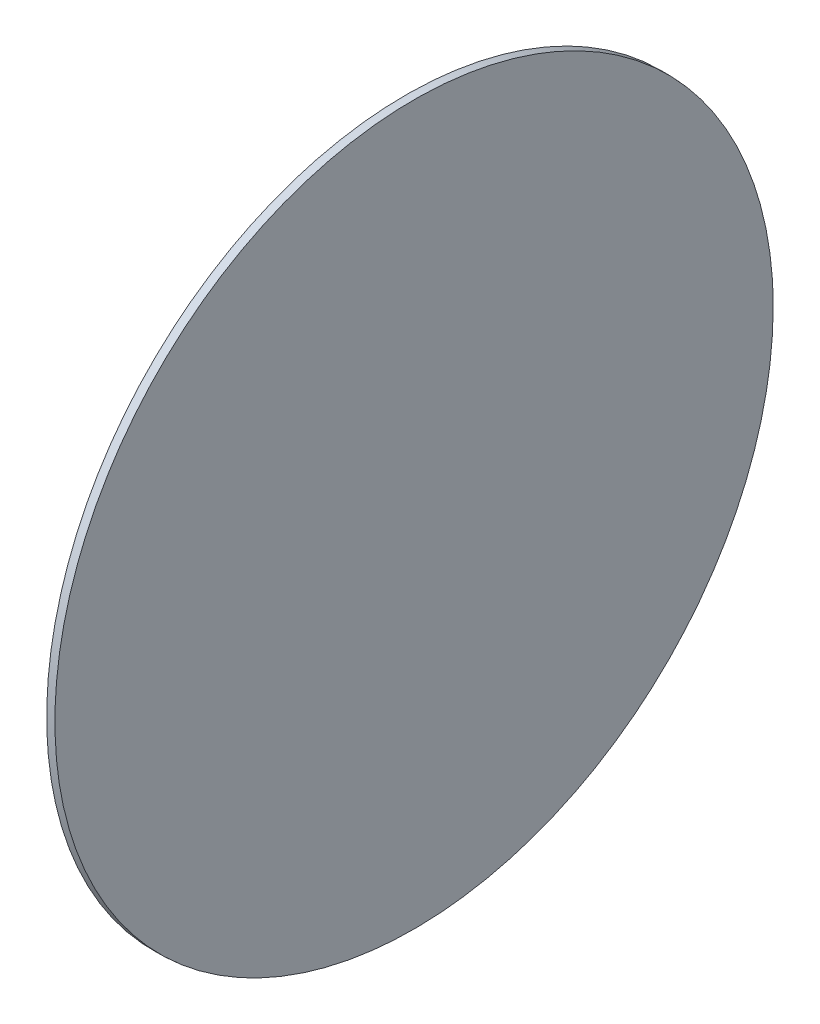
ISO-10303-21;
HEADER;
FILE_DESCRIPTION(('STEP AP214'),'2;1');
FILE_NAME('part.step','',(''),(''),'','','');
FILE_SCHEMA(('AUTOMOTIVE_DESIGN { 1 0 10303 214 1 1 1 1 }'));
ENDSEC;
DATA;
#1=APPLICATION_CONTEXT('core data for automotive mechanical design processes');
#2=APPLICATION_PROTOCOL_DEFINITION('international standard','automotive_design',2000,#1);
#3=PRODUCT_CONTEXT('',#1,'mechanical');
#4=PRODUCT('Part','Part','',(#3));
#5=PRODUCT_RELATED_PRODUCT_CATEGORY('part','',(#4));
#6=PRODUCT_DEFINITION_FORMATION('','',#4);
#7=PRODUCT_DEFINITION_CONTEXT('part definition',#1,'design');
#8=PRODUCT_DEFINITION('design','',#6,#7);
#9=PRODUCT_DEFINITION_SHAPE('','',#8);
#10=(LENGTH_UNIT() NAMED_UNIT(*) SI_UNIT(.MILLI.,.METRE.));
#11=(NAMED_UNIT(*) PLANE_ANGLE_UNIT() SI_UNIT($,.RADIAN.));
#12=(NAMED_UNIT(*) SI_UNIT($,.STERADIAN.) SOLID_ANGLE_UNIT());
#13=UNCERTAINTY_MEASURE_WITH_UNIT(LENGTH_MEASURE(1.E-05),#10,'distance_accuracy_value','');
#14=(GEOMETRIC_REPRESENTATION_CONTEXT(3) GLOBAL_UNCERTAINTY_ASSIGNED_CONTEXT((#13)) GLOBAL_UNIT_ASSIGNED_CONTEXT((#10,
#11,#12)) REPRESENTATION_CONTEXT('',''));
#15=CARTESIAN_POINT('',(0.,0.,0.));
#16=DIRECTION('',(0.,0.,1.));
#17=DIRECTION('',(1.,0.,0.));
#18=AXIS2_PLACEMENT_3D('',#15,#16,#17);
#19=CARTESIAN_POINT('',(256.137650820257,176.743383940744,-231.47823397477));
#20=CARTESIAN_POINT('',(256.137650820257,168.330757265667,-231.47823397477));
#21=CARTESIAN_POINT('',(256.137650820257,151.505503915513,-230.651662281104));
#22=CARTESIAN_POINT('',(256.137650820257,126.510678471353,-226.944030165496));
#23=CARTESIAN_POINT('',(256.137650820257,101.999621440854,-220.804329998851));
#24=CARTESIAN_POINT('',(256.137650820257,78.2083877023261,-212.291690450074));
#25=CARTESIAN_POINT('',(256.137650820257,55.3660998422819,-201.488092891503));
#26=CARTESIAN_POINT('',(256.137650820257,33.6927415796788,-188.497581873475));
#27=CARTESIAN_POINT('',(256.137650820257,13.3970392024482,-173.445263118427));
#28=CARTESIAN_POINT('',(256.137650820257,-5.32554858075743,-156.476098684406));
#29=CARTESIAN_POINT('',(256.137650820257,-22.2947130147782,-137.7535109012));
#30=CARTESIAN_POINT('',(256.137650820257,-37.347031769826,-117.45780852397));
#31=CARTESIAN_POINT('',(256.137650820257,-50.3375427878549,-95.7844502613667));
#32=CARTESIAN_POINT('',(256.137650820257,-61.1411403464257,-72.9421624013225));
#33=CARTESIAN_POINT('',(256.137650820257,-69.6537798952023,-49.1509286627942));
#34=CARTESIAN_POINT('',(256.137650820257,-75.7934800618477,-24.6398716322952));
#35=CARTESIAN_POINT('',(256.137650820257,-79.5011121774556,0.354953811864101));
#36=CARTESIAN_POINT('',(256.137650820257,-80.740969717955,25.5928338370949));
#37=CARTESIAN_POINT('',(256.137650820257,-79.5011121774557,50.8307138623259));
#38=CARTESIAN_POINT('',(256.137650820257,-75.7934800618476,75.825539306485));
#39=CARTESIAN_POINT('',(256.137650820257,-69.6537798952023,100.336596336984));
#40=CARTESIAN_POINT('',(256.137650820257,-61.1411403464257,124.127830075512));
#41=CARTESIAN_POINT('',(256.137650820257,-50.3375427878549,146.970117935557));
#42=CARTESIAN_POINT('',(256.137650820257,-37.347031769826,168.64347619816));
#43=CARTESIAN_POINT('',(256.137650820257,-22.2947130147783,188.93917857539));
#44=CARTESIAN_POINT('',(256.137650820257,-5.3255485807575,207.661766358596));
#45=CARTESIAN_POINT('',(256.137650820257,13.3970392024483,224.630930792617));
#46=CARTESIAN_POINT('',(256.137650820257,33.6927415796788,239.683249547665));
#47=CARTESIAN_POINT('',(256.137650820257,55.3660998422819,252.673760565693));
#48=CARTESIAN_POINT('',(256.137650820257,78.2083877023262,263.477358124264));
#49=CARTESIAN_POINT('',(256.137650820257,101.999621440854,271.989997673041));
#50=CARTESIAN_POINT('',(256.137650820257,126.510678471353,278.129697839686));
#51=CARTESIAN_POINT('',(256.137650820257,151.505503915513,281.837329955294));
#52=CARTESIAN_POINT('',(256.137650820257,176.743383940744,283.077187495794));
#53=CARTESIAN_POINT('',(256.137650820257,201.981263965974,281.837329955294));
#54=CARTESIAN_POINT('',(256.137650820257,226.976089410134,278.129697839686));
#55=CARTESIAN_POINT('',(256.137650820257,251.487146440633,271.989997673041));
#56=CARTESIAN_POINT('',(256.137650820257,275.278380179161,263.477358124264));
#57=CARTESIAN_POINT('',(256.137650820257,298.120668039205,252.673760565693));
#58=CARTESIAN_POINT('',(256.137650820257,319.794026301808,239.683249547665));
#59=CARTESIAN_POINT('',(256.137650820257,340.089728679039,224.630930792617));
#60=CARTESIAN_POINT('',(256.137650820257,358.812316462244,207.661766358596));
#61=CARTESIAN_POINT('',(256.137650820257,375.781480896266,188.93917857539));
#62=CARTESIAN_POINT('',(256.137650820257,390.833799651313,168.64347619816));
#63=CARTESIAN_POINT('',(256.137650820257,403.824310669342,146.970117935557));
#64=CARTESIAN_POINT('',(256.137650820257,414.627908227913,124.127830075512));
#65=CARTESIAN_POINT('',(256.137650820257,423.140547776689,100.336596336984));
#66=CARTESIAN_POINT('',(256.137650820257,429.280247943335,75.8255393064853));
#67=CARTESIAN_POINT('',(256.137650820257,432.987880058943,50.830713862326));
#68=CARTESIAN_POINT('',(256.137650820257,434.227737599442,25.5928338370949));
#69=CARTESIAN_POINT('',(256.137650820257,432.987880058943,0.354953811864209));
#70=CARTESIAN_POINT('',(256.137650820257,429.280247943335,-24.6398716322952));
#71=CARTESIAN_POINT('',(256.137650820257,423.140547776689,-49.1509286627942));
#72=CARTESIAN_POINT('',(256.137650820257,414.627908227913,-72.9421624013226));
#73=CARTESIAN_POINT('',(256.137650820257,403.824310669342,-95.7844502613666));
#74=CARTESIAN_POINT('',(256.137650820257,390.833799651313,-117.45780852397));
#75=CARTESIAN_POINT('',(256.137650820257,375.781480896265,-137.7535109012));
#76=CARTESIAN_POINT('',(256.137650820257,358.812316462245,-156.476098684406));
#77=CARTESIAN_POINT('',(256.137650820257,340.089728679039,-173.445263118427));
#78=CARTESIAN_POINT('',(256.137650820257,319.794026301809,-188.497581873475));
#79=CARTESIAN_POINT('',(256.137650820257,298.120668039205,-201.488092891503));
#80=CARTESIAN_POINT('',(256.137650820257,275.278380179161,-212.291690450074));
#81=CARTESIAN_POINT('',(256.137650820257,251.487146440633,-220.804329998851));
#82=CARTESIAN_POINT('',(256.137650820257,226.976089410134,-226.944030165496));
#83=CARTESIAN_POINT('',(256.137650820257,201.981263965974,-230.651662281104));
#84=CARTESIAN_POINT('',(256.137650820257,185.156010615821,-231.47823397477));
#85=CARTESIAN_POINT('',(256.137650820257,176.743383940744,-231.47823397477));
#86=B_SPLINE_CURVE_WITH_KNOTS('',3,(#19,#20,#21,#22,#23,#24,#25,#26,#27,#28,#29,#30,#31,#32,#33,
#34,#35,#36,#37,#38,#39,#40,#41,#42,#43,#44,#45,#46,#47,#48,#49,#50,#51,#52,#53,#54,#55,#56,#57,
#58,#59,#60,#61,#62,#63,#64,#65,#66,#67,#68,#69,#70,#71,#72,#73,#74,#75,#76,#77,#78,#79,#80,#81,
#82,#83,#84,#85),.UNSPECIFIED.,.T.,.F.,(4,1,1,1,1,1,1,1,1,1,1,1,1,1,1,1,1,1,1,1,1,1,1,1,1,1,1,1,
1,1,1,1,1,1,1,1,1,1,1,1,1,1,1,1,1,1,1,1,1,1,1,1,1,1,1,1,1,1,1,1,1,1,1,1,4),(0.,0.015625,0.03125,
0.046875,0.0625,0.0781249999999999,0.0937499999999999,0.109375,0.125,0.140625,0.15625,0.171875,
0.1875,0.203125,0.21875,0.234375,0.25,0.265625,0.28125,0.296875,0.3125,0.328125,0.34375,
0.359375,0.375,0.390625,0.40625,0.421875,0.4375,0.453125,0.46875,0.484375,0.5,0.515625,0.53125,
0.546875,0.5625,0.578125,0.59375,0.609375,0.625,0.640625,0.65625,0.671875,0.6875,0.703125,
0.71875,0.734375,0.75,0.765625,0.78125,0.796875,0.8125,0.828125,0.84375,0.859375,0.875,0.890625,
0.90625,0.921875,0.9375,0.953125,0.96875,0.984375,1.),.UNSPECIFIED.);
#87=DIRECTION('',(1.,0.,0.));
#88=VECTOR('',#87,1.);
#89=SURFACE_OF_LINEAR_EXTRUSION('',#86,#88);
#90=CARTESIAN_POINT('',(256.137650820257,176.743383940744,-231.47823397477));
#91=CARTESIAN_POINT('',(256.137650820257,180.949697278282,-231.47823397477));
#92=CARTESIAN_POINT('',(256.137650820257,185.156010615821,-231.374912513062));
#93=CARTESIAN_POINT('',(256.137650820257,193.558510016686,-230.962124187308));
#94=CARTESIAN_POINT('',(256.137650820257,197.754696080013,-230.652657323262));
#95=CARTESIAN_POINT('',(256.137650820257,206.126813658245,-229.828075713911));
#96=CARTESIAN_POINT('',(256.137650820257,210.30274517315,-229.312960968605));
#97=CARTESIAN_POINT('',(256.137650820257,218.624323911511,-228.078571368572));
#98=CARTESIAN_POINT('',(256.137650820257,222.769971134969,-227.359296513844));
#99=CARTESIAN_POINT('',(256.137650820257,231.020951547412,-225.718074466802));
#100=CARTESIAN_POINT('',(256.137650820257,235.126284736398,-224.796127274488));
#101=CARTESIAN_POINT('',(256.137650820257,243.286801459968,-222.752024246811));
#102=CARTESIAN_POINT('',(256.137650820257,247.341984994552,-221.629868411448));
#103=CARTESIAN_POINT('',(256.137650820257,255.39236678939,-219.187811792211));
#104=CARTESIAN_POINT('',(256.137650820257,259.387565049643,-217.867911008337));
#105=CARTESIAN_POINT('',(256.137650820257,267.308429521381,-215.033780382592));
#106=CARTESIAN_POINT('',(256.137650820257,271.234095732866,-213.519550540721));
#107=CARTESIAN_POINT('',(256.137650820257,279.006349332628,-210.300177689496));
#108=CARTESIAN_POINT('',(256.137650820257,282.852936720906,-208.595034680143));
#109=CARTESIAN_POINT('',(256.137650820257,290.457866685964,-204.99817068355));
#110=CARTESIAN_POINT('',(256.137650820257,294.216209262744,-203.10644969631));
#111=CARTESIAN_POINT('',(256.137650820257,301.635483616519,-199.140764933544));
#112=CARTESIAN_POINT('',(256.137650820257,305.296415393513,-197.066801158016));
#113=CARTESIAN_POINT('',(256.137650820257,312.51217121905,-192.741843557108));
#114=CARTESIAN_POINT('',(256.137650820257,316.066995267594,-190.490849731728));
#115=CARTESIAN_POINT('',(256.137650820257,323.061838707566,-185.817044769548));
#116=CARTESIAN_POINT('',(256.137650820257,326.501858098995,-183.39423363275));
#117=CARTESIAN_POINT('',(256.137650820257,333.258948111878,-178.382834133486));
#118=CARTESIAN_POINT('',(256.137650820257,336.576018733332,-175.79424577102));
#119=CARTESIAN_POINT('',(256.137650820257,343.079067093404,-170.457331906176));
#120=CARTESIAN_POINT('',(256.137650820257,346.265044832023,-167.709006403796));
#121=CARTESIAN_POINT('',(256.137650820257,352.498394561627,-162.059427522864));
#122=CARTESIAN_POINT('',(256.137650820257,355.545766552611,-159.158174144311));
#123=CARTESIAN_POINT('',(256.137650820257,361.494391922149,-153.209548774773));
#124=CARTESIAN_POINT('',(256.137650820257,364.395645300702,-150.162176783788));
#125=CARTESIAN_POINT('',(256.137650820257,370.045224181634,-143.928827054185));
#126=CARTESIAN_POINT('',(256.137650820257,372.793549684014,-140.742849315566));
#127=CARTESIAN_POINT('',(256.137650820257,378.130463548859,-134.239800955493));
#128=CARTESIAN_POINT('',(256.137650820257,380.719051911324,-130.922730334039));
#129=CARTESIAN_POINT('',(256.137650820257,385.730451410588,-124.165640321156));
#130=CARTESIAN_POINT('',(256.137650820257,388.153262547387,-120.725620929727));
#131=CARTESIAN_POINT('',(256.137650820257,392.827067509566,-113.730777489755));
#132=CARTESIAN_POINT('',(256.137650820257,395.078061334947,-110.175953441212));
#133=CARTESIAN_POINT('',(256.137650820257,399.403018935855,-102.960197615674));
#134=CARTESIAN_POINT('',(256.137650820257,401.476982711382,-99.2992658386805));
#135=CARTESIAN_POINT('',(256.137650820257,405.442667474149,-91.879991484906));
#136=CARTESIAN_POINT('',(256.137650820257,407.334388461388,-88.1216489081254));
#137=CARTESIAN_POINT('',(256.137650820257,410.931252457981,-80.5167189430672));
#138=CARTESIAN_POINT('',(256.137650820257,412.636395467335,-76.6701315547897));
#139=CARTESIAN_POINT('',(256.137650820257,415.855768318559,-68.8978779550276));
#140=CARTESIAN_POINT('',(256.137650820257,417.36999816043,-64.972211743543));
#141=CARTESIAN_POINT('',(256.137650820257,420.204128786175,-57.051347271805));
#142=CARTESIAN_POINT('',(256.137650820257,421.524029570049,-53.0561490115515));
#143=CARTESIAN_POINT('',(256.137650820257,423.966086189286,-45.0057672167136));
#144=CARTESIAN_POINT('',(256.137650820257,425.088242024649,-40.9505836821292));
#145=CARTESIAN_POINT('',(256.137650820257,427.132345052326,-32.7900669585592));
#146=CARTESIAN_POINT('',(256.137650820257,428.054292244641,-28.6847337695735));
#147=CARTESIAN_POINT('',(256.137650820257,429.695514291683,-20.4337533571305));
#148=CARTESIAN_POINT('',(256.137650820257,430.414789146411,-16.2881061336731));
#149=CARTESIAN_POINT('',(256.137650820257,431.649178746444,-7.9665273953112));
#150=CARTESIAN_POINT('',(256.137650820257,432.164293491749,-3.79059588040668));
#151=CARTESIAN_POINT('',(256.137650820257,432.9888751011,4.58152169782498));
#152=CARTESIAN_POINT('',(256.137650820257,433.298341965146,8.77770776115213));
#153=CARTESIAN_POINT('',(256.137650820257,433.711130290901,17.1802071620177));
#154=CARTESIAN_POINT('',(256.137650820257,433.814451752609,21.3865204995562));
#155=CARTESIAN_POINT('',(256.137650820257,433.814451752609,29.7991471746332));
#156=CARTESIAN_POINT('',(256.137650820257,433.711130290901,34.0054605121717));
#157=CARTESIAN_POINT('',(256.137650820257,433.298341965146,42.4079599130373));
#158=CARTESIAN_POINT('',(256.137650820257,432.9888751011,46.6041459763645));
#159=CARTESIAN_POINT('',(256.137650820257,432.164293491749,54.9762635545962));
#160=CARTESIAN_POINT('',(256.137650820257,431.649178746444,59.1521950695008));
#161=CARTESIAN_POINT('',(256.137650820257,430.414789146411,67.4737738078627));
#162=CARTESIAN_POINT('',(256.137650820257,429.695514291683,71.61942103132));
#163=CARTESIAN_POINT('',(256.137650820257,428.054292244641,79.870401443763));
#164=CARTESIAN_POINT('',(256.137650820257,427.132345052326,83.9757346327487));
#165=CARTESIAN_POINT('',(256.137650820257,425.088242024649,92.1362513563188));
#166=CARTESIAN_POINT('',(256.137650820257,423.966086189286,96.1914348909031));
#167=CARTESIAN_POINT('',(256.137650820257,421.524029570049,104.241816685741));
#168=CARTESIAN_POINT('',(256.137650820257,420.204128786175,108.237014945994));
#169=CARTESIAN_POINT('',(256.137650820257,417.36999816043,116.157879417732));
#170=CARTESIAN_POINT('',(256.137650820257,415.85576831856,120.083545629217));
#171=CARTESIAN_POINT('',(256.137650820257,412.636395467335,127.855799228979));
#172=CARTESIAN_POINT('',(256.137650820257,410.931252457981,131.702386617257));
#173=CARTESIAN_POINT('',(256.137650820257,407.334388461388,139.307316582315));
#174=CARTESIAN_POINT('',(256.137650820257,405.442667474149,143.065659159096));
#175=CARTESIAN_POINT('',(256.137650820257,401.476982711383,150.48493351287));
#176=CARTESIAN_POINT('',(256.137650820257,399.403018935855,154.145865289864));
#177=CARTESIAN_POINT('',(256.137650820257,395.078061334947,161.361621115401));
#178=CARTESIAN_POINT('',(256.137650820257,392.827067509567,164.916445163945));
#179=CARTESIAN_POINT('',(256.137650820257,388.153262547387,171.911288603917));
#180=CARTESIAN_POINT('',(256.137650820257,385.730451410588,175.351307995346));
#181=CARTESIAN_POINT('',(256.137650820257,380.719051911324,182.108398008229));
#182=CARTESIAN_POINT('',(256.137650820257,378.130463548859,185.425468629683));
#183=CARTESIAN_POINT('',(256.137650820257,372.793549684014,191.928516989756));
#184=CARTESIAN_POINT('',(256.137650820257,370.045224181635,195.114494728374));
#185=CARTESIAN_POINT('',(256.137650820257,364.395645300702,201.347844457978));
#186=CARTESIAN_POINT('',(256.137650820257,361.494391922149,204.395216448963));
#187=CARTESIAN_POINT('',(256.137650820257,355.545766552612,210.3438418185));
#188=CARTESIAN_POINT('',(256.137650820257,352.498394561627,213.245095197053));
#189=CARTESIAN_POINT('',(256.137650820257,346.265044832023,218.894674077986));
#190=CARTESIAN_POINT('',(256.137650820257,343.079067093405,221.642999580365));
#191=CARTESIAN_POINT('',(256.137650820257,336.576018733332,226.97991344521));
#192=CARTESIAN_POINT('',(256.137650820257,333.258948111878,229.568501807675));
#193=CARTESIAN_POINT('',(256.137650820257,326.501858098995,234.579901306939));
#194=CARTESIAN_POINT('',(256.137650820257,323.061838707566,237.002712443738));
#195=CARTESIAN_POINT('',(256.137650820257,316.066995267594,241.676517405918));
#196=CARTESIAN_POINT('',(256.137650820257,312.512171219051,243.927511231298));
#197=CARTESIAN_POINT('',(256.137650820257,305.296415393513,248.252468832206));
#198=CARTESIAN_POINT('',(256.137650820257,301.635483616519,250.326432607734));
#199=CARTESIAN_POINT('',(256.137650820257,294.216209262745,254.2921173705));
#200=CARTESIAN_POINT('',(256.137650820257,290.457866685964,256.183838357739));
#201=CARTESIAN_POINT('',(256.137650820257,282.852936720906,259.780702354332));
#202=CARTESIAN_POINT('',(256.137650820257,279.006349332628,261.485845363686));
#203=CARTESIAN_POINT('',(256.137650820257,271.234095732866,264.705218214911));
#204=CARTESIAN_POINT('',(256.137650820257,267.308429521382,266.219448056782));
#205=CARTESIAN_POINT('',(256.137650820257,259.387565049644,269.053578682526));
#206=CARTESIAN_POINT('',(256.137650820257,255.39236678939,270.3734794664));
#207=CARTESIAN_POINT('',(256.137650820257,247.341984994552,272.815536085637));
#208=CARTESIAN_POINT('',(256.137650820257,243.286801459968,273.937691921));
#209=CARTESIAN_POINT('',(256.137650820257,235.126284736398,275.981794948678));
#210=CARTESIAN_POINT('',(256.137650820257,231.020951547412,276.903742140992));
#211=CARTESIAN_POINT('',(256.137650820257,222.769971134969,278.544964188034));
#212=CARTESIAN_POINT('',(256.137650820257,218.624323911512,279.264239042762));
#213=CARTESIAN_POINT('',(256.137650820257,210.30274517315,280.498628642795));
#214=CARTESIAN_POINT('',(256.137650820257,206.126813658245,281.0137433881));
#215=CARTESIAN_POINT('',(256.137650820257,197.754696080014,281.838324997452));
#216=CARTESIAN_POINT('',(256.137650820257,193.558510016687,282.147791861498));
#217=CARTESIAN_POINT('',(256.137650820257,185.156010615821,282.560580187252));
#218=CARTESIAN_POINT('',(256.137650820257,180.949697278282,282.663901648961));
#219=CARTESIAN_POINT('',(256.137650820257,172.537070603206,282.663901648961));
#220=CARTESIAN_POINT('',(256.137650820257,168.330757265667,282.560580187252));
#221=CARTESIAN_POINT('',(256.137650820257,159.928257864801,282.147791861498));
#222=CARTESIAN_POINT('',(256.137650820257,155.732071801474,281.838324997452));
#223=CARTESIAN_POINT('',(256.137650820257,147.359954223243,281.013743388101));
#224=CARTESIAN_POINT('',(256.137650820257,143.184022708338,280.498628642795));
#225=CARTESIAN_POINT('',(256.137650820257,134.862443969976,279.264239042762));
#226=CARTESIAN_POINT('',(256.137650820257,130.716796746519,278.544964188035));
#227=CARTESIAN_POINT('',(256.137650820257,122.465816334076,276.903742140992));
#228=CARTESIAN_POINT('',(256.137650820257,118.36048314509,275.981794948678));
#229=CARTESIAN_POINT('',(256.137650820257,110.19996642152,273.937691921001));
#230=CARTESIAN_POINT('',(256.137650820257,106.144782886936,272.815536085638));
#231=CARTESIAN_POINT('',(256.137650820257,98.0944010920977,270.373479466401));
#232=CARTESIAN_POINT('',(256.137650820257,94.0992028318442,269.053578682527));
#233=CARTESIAN_POINT('',(256.137650820257,86.1783383601062,266.219448056782));
#234=CARTESIAN_POINT('',(256.137650820257,82.2526721486217,264.705218214911));
#235=CARTESIAN_POINT('',(256.137650820257,74.4804185488596,261.485845363687));
#236=CARTESIAN_POINT('',(256.137650820257,70.633831160582,259.780702354333));
#237=CARTESIAN_POINT('',(256.137650820257,63.0289011955238,256.18383835774));
#238=CARTESIAN_POINT('',(256.137650820257,59.2705586187432,254.292117370501));
#239=CARTESIAN_POINT('',(256.137650820257,51.8512842649686,250.326432607734));
#240=CARTESIAN_POINT('',(256.137650820257,48.1903524879747,248.252468832207));
#241=CARTESIAN_POINT('',(256.137650820257,40.9745966624374,243.927511231299));
#242=CARTESIAN_POINT('',(256.137650820257,37.4197726138941,241.676517405918));
#243=CARTESIAN_POINT('',(256.137650820257,30.4249291739218,237.002712443739));
#244=CARTESIAN_POINT('',(256.137650820257,26.9849097824929,234.57990130694));
#245=CARTESIAN_POINT('',(256.137650820257,20.2278197696099,229.568501807676));
#246=CARTESIAN_POINT('',(256.137650820257,16.9107491481558,226.979913445211));
#247=CARTESIAN_POINT('',(256.137650820257,10.4077007880831,221.642999580366));
#248=CARTESIAN_POINT('',(256.137650820257,7.22172304946442,218.894674077986));
#249=CARTESIAN_POINT('',(256.137650820257,0.988373319860833,213.245095197054));
#250=CARTESIAN_POINT('',(256.137650820257,-2.05899867112409,210.343841818501));
#251=CARTESIAN_POINT('',(256.137650820257,-8.00762404066186,204.395216448963));
#252=CARTESIAN_POINT('',(256.137650820257,-10.9088774192147,201.347844457978));
#253=CARTESIAN_POINT('',(256.137650820257,-16.5584563001472,195.114494728375));
#254=CARTESIAN_POINT('',(256.137650820257,-19.3067818025268,191.928516989756));
#255=CARTESIAN_POINT('',(256.137650820257,-24.6436956673715,185.425468629684));
#256=CARTESIAN_POINT('',(256.137650820257,-27.2322840298367,182.108398008229));
#257=CARTESIAN_POINT('',(256.137650820257,-32.2436835291007,175.351307995347));
#258=CARTESIAN_POINT('',(256.137650820257,-34.6664946658995,171.911288603918));
#259=CARTESIAN_POINT('',(256.137650820257,-39.340299628079,164.916445163945));
#260=CARTESIAN_POINT('',(256.137650820257,-41.5912934534596,161.361621115402));
#261=CARTESIAN_POINT('',(256.137650820257,-45.9162510543676,154.145865289865));
#262=CARTESIAN_POINT('',(256.137650820257,-47.990214829895,150.484933512871));
#263=CARTESIAN_POINT('',(256.137650820257,-51.9558995926616,143.065659159096));
#264=CARTESIAN_POINT('',(256.137650820257,-53.8476205799008,139.307316582316));
#265=CARTESIAN_POINT('',(256.137650820257,-57.4444845764938,131.702386617257));
#266=CARTESIAN_POINT('',(256.137650820257,-59.1496275858475,127.85579922898));
#267=CARTESIAN_POINT('',(256.137650820257,-62.3690004370721,120.083545629218));
#268=CARTESIAN_POINT('',(256.137650820257,-63.883230278943,116.157879417733));
#269=CARTESIAN_POINT('',(256.137650820257,-66.7173609046878,108.237014945995));
#270=CARTESIAN_POINT('',(256.137650820257,-68.0372616885618,104.241816685742));
#271=CARTESIAN_POINT('',(256.137650820257,-70.4793183077988,96.1914348909038));
#272=CARTESIAN_POINT('',(256.137650820257,-71.6014741431618,92.1362513563194));
#273=CARTESIAN_POINT('',(256.137650820257,-73.6455771708392,83.9757346327493));
#274=CARTESIAN_POINT('',(256.137650820257,-74.5675243631535,79.8704014437636));
#275=CARTESIAN_POINT('',(256.137650820257,-76.2087464101958,71.6194210313205));
#276=CARTESIAN_POINT('',(256.137650820257,-76.9280212649237,67.4737738078632));
#277=CARTESIAN_POINT('',(256.137650820257,-78.1624108649568,59.1521950695013));
#278=CARTESIAN_POINT('',(256.137650820257,-78.6775256102619,54.9762635545968));
#279=CARTESIAN_POINT('',(256.137650820257,-79.5021072196132,46.6041459763651));
#280=CARTESIAN_POINT('',(256.137650820257,-79.8115740836592,42.4079599130379));
#281=CARTESIAN_POINT('',(256.137650820257,-80.2243624094136,34.0054605121722));
#282=CARTESIAN_POINT('',(256.137650820257,-80.3276838711219,29.7991471746337));
#283=CARTESIAN_POINT('',(256.137650820257,-80.3276838711218,21.3865204995568));
#284=CARTESIAN_POINT('',(256.137650820257,-80.2243624094136,17.1802071620183));
#285=CARTESIAN_POINT('',(256.137650820257,-79.8115740836592,8.77770776115265));
#286=CARTESIAN_POINT('',(256.137650820257,-79.5021072196131,4.5815216978255));
#287=CARTESIAN_POINT('',(256.137650820257,-78.6775256102619,-3.79059588040619));
#288=CARTESIAN_POINT('',(256.137650820257,-78.1624108649568,-7.96652739531072));
#289=CARTESIAN_POINT('',(256.137650820257,-76.9280212649238,-16.2881061336726));
#290=CARTESIAN_POINT('',(256.137650820257,-76.2087464101959,-20.43375335713));
#291=CARTESIAN_POINT('',(256.137650820257,-74.5675243631537,-28.684733769573));
#292=CARTESIAN_POINT('',(256.137650820257,-73.6455771708394,-32.7900669585587));
#293=CARTESIAN_POINT('',(256.137650820257,-71.601474143162,-40.9505836821288));
#294=CARTESIAN_POINT('',(256.137650820257,-70.479318307799,-45.0057672167132));
#295=CARTESIAN_POINT('',(256.137650820257,-68.037261688562,-53.0561490115511));
#296=CARTESIAN_POINT('',(256.137650820257,-66.717360904688,-57.0513472718046));
#297=CARTESIAN_POINT('',(256.137650820257,-63.8832302789432,-64.9722117435426));
#298=CARTESIAN_POINT('',(256.137650820257,-62.3690004370723,-68.8978779550272));
#299=CARTESIAN_POINT('',(256.137650820257,-59.1496275858478,-76.6701315547893));
#300=CARTESIAN_POINT('',(256.137650820257,-57.4444845764941,-80.5167189430668));
#301=CARTESIAN_POINT('',(256.137650820257,-53.8476205799012,-88.1216489081251));
#302=CARTESIAN_POINT('',(256.137650820257,-51.9558995926619,-91.8799914849057));
#303=CARTESIAN_POINT('',(256.137650820257,-47.9902148298953,-99.2992658386803));
#304=CARTESIAN_POINT('',(256.137650820257,-45.9162510543679,-102.960197615674));
#305=CARTESIAN_POINT('',(256.137650820257,-41.59129345346,-110.175953441211));
#306=CARTESIAN_POINT('',(256.137650820257,-39.3402996280794,-113.730777489755));
#307=CARTESIAN_POINT('',(256.137650820257,-34.6664946658999,-120.725620929727));
#308=CARTESIAN_POINT('',(256.137650820257,-32.2436835291011,-124.165640321156));
#309=CARTESIAN_POINT('',(256.137650820257,-27.2322840298371,-130.922730334039));
#310=CARTESIAN_POINT('',(256.137650820257,-24.6436956673719,-134.239800955493));
#311=CARTESIAN_POINT('',(256.137650820257,-19.3067818025271,-140.742849315566));
#312=CARTESIAN_POINT('',(256.137650820257,-16.5584563001475,-143.928827054184));
#313=CARTESIAN_POINT('',(256.137650820257,-10.9088774192151,-150.162176783788));
#314=CARTESIAN_POINT('',(256.137650820257,-8.00762404066225,-153.209548774773));
#315=CARTESIAN_POINT('',(256.137650820257,-2.0589986711245,-159.158174144311));
#316=CARTESIAN_POINT('',(256.137650820257,0.988373319860394,-162.059427522864));
#317=CARTESIAN_POINT('',(256.137650820257,7.22172304946394,-167.709006403796));
#318=CARTESIAN_POINT('',(256.137650820257,10.4077007880826,-170.457331906176));
#319=CARTESIAN_POINT('',(256.137650820257,16.9107491481553,-175.79424577102));
#320=CARTESIAN_POINT('',(256.137650820257,20.2278197696093,-178.382834133485));
#321=CARTESIAN_POINT('',(256.137650820257,26.9849097824924,-183.394233632749));
#322=CARTESIAN_POINT('',(256.137650820257,30.4249291739213,-185.817044769548));
#323=CARTESIAN_POINT('',(256.137650820257,37.4197726138936,-190.490849731728));
#324=CARTESIAN_POINT('',(256.137650820257,40.9745966624369,-192.741843557108));
#325=CARTESIAN_POINT('',(256.137650820257,48.1903524879742,-197.066801158016));
#326=CARTESIAN_POINT('',(256.137650820257,51.8512842649681,-199.140764933544));
#327=CARTESIAN_POINT('',(256.137650820257,59.2705586187427,-203.10644969631));
#328=CARTESIAN_POINT('',(256.137650820257,63.0289011955233,-204.99817068355));
#329=CARTESIAN_POINT('',(256.137650820257,70.6338311605815,-208.595034680143));
#330=CARTESIAN_POINT('',(256.137650820257,74.480418548859,-210.300177689496));
#331=CARTESIAN_POINT('',(256.137650820257,82.2526721486211,-213.519550540721));
#332=CARTESIAN_POINT('',(256.137650820257,86.1783383601057,-215.033780382592));
#333=CARTESIAN_POINT('',(256.137650820257,94.0992028318437,-217.867911008336));
#334=CARTESIAN_POINT('',(256.137650820257,98.0944010920972,-219.18781179221));
#335=CARTESIAN_POINT('',(256.137650820257,106.144782886935,-221.629868411447));
#336=CARTESIAN_POINT('',(256.137650820257,110.199966421519,-222.75202424681));
#337=CARTESIAN_POINT('',(256.137650820257,118.36048314509,-224.796127274488));
#338=CARTESIAN_POINT('',(256.137650820257,122.465816334075,-225.718074466802));
#339=CARTESIAN_POINT('',(256.137650820257,130.716796746518,-227.359296513844));
#340=CARTESIAN_POINT('',(256.137650820257,134.862443969976,-228.078571368572));
#341=CARTESIAN_POINT('',(256.137650820257,143.184022708338,-229.312960968605));
#342=CARTESIAN_POINT('',(256.137650820257,147.359954223242,-229.828075713911));
#343=CARTESIAN_POINT('',(256.137650820257,155.732071801474,-230.652657323262));
#344=CARTESIAN_POINT('',(256.137650820257,159.928257864801,-230.962124187308));
#345=CARTESIAN_POINT('',(256.137650820257,168.330757265667,-231.374912513062));
#346=CARTESIAN_POINT('',(256.137650820257,172.537070603205,-231.47823397477));
#347=CARTESIAN_POINT('',(256.137650820257,176.743383940744,-231.47823397477));
#348=B_SPLINE_CURVE_WITH_KNOTS('',3,(#90,#91,#92,#93,#94,#95,#96,#97,#98,#99,#100,#101,#102,
#103,#104,#105,#106,#107,#108,#109,#110,#111,#112,#113,#114,#115,#116,#117,#118,#119,#120,#121,
#122,#123,#124,#125,#126,#127,#128,#129,#130,#131,#132,#133,#134,#135,#136,#137,#138,#139,#140,
#141,#142,#143,#144,#145,#146,#147,#148,#149,#150,#151,#152,#153,#154,#155,#156,#157,#158,#159,
#160,#161,#162,#163,#164,#165,#166,#167,#168,#169,#170,#171,#172,#173,#174,#175,#176,#177,#178,
#179,#180,#181,#182,#183,#184,#185,#186,#187,#188,#189,#190,#191,#192,#193,#194,#195,#196,#197,
#198,#199,#200,#201,#202,#203,#204,#205,#206,#207,#208,#209,#210,#211,#212,#213,#214,#215,#216,
#217,#218,#219,#220,#221,#222,#223,#224,#225,#226,#227,#228,#229,#230,#231,#232,#233,#234,#235,
#236,#237,#238,#239,#240,#241,#242,#243,#244,#245,#246,#247,#248,#249,#250,#251,#252,#253,#254,
#255,#256,#257,#258,#259,#260,#261,#262,#263,#264,#265,#266,#267,#268,#269,#270,#271,#272,#273,
#274,#275,#276,#277,#278,#279,#280,#281,#282,#283,#284,#285,#286,#287,#288,#289,#290,#291,#292,
#293,#294,#295,#296,#297,#298,#299,#300,#301,#302,#303,#304,#305,#306,#307,#308,#309,#310,#311,
#312,#313,#314,#315,#316,#317,#318,#319,#320,#321,#322,#323,#324,#325,#326,#327,#328,#329,#330,
#331,#332,#333,#334,#335,#336,#337,#338,#339,#340,#341,#342,#343,#344,#345,#346,#347),
.UNSPECIFIED.,.F.,.F.,(4,2,2,2,2,2,2,2,2,2,2,2,2,2,2,2,2,2,2,2,2,2,2,2,2,2,2,2,2,2,2,2,2,2,2,2,
2,2,2,2,2,2,2,2,2,2,2,2,2,2,2,2,2,2,2,2,2,2,2,2,2,2,2,2,2,2,2,2,2,2,2,2,2,2,2,2,2,2,2,2,2,2,2,2,
2,2,2,2,2,2,2,2,2,2,2,2,2,2,2,2,2,2,2,2,2,2,2,2,2,2,2,2,2,2,2,2,2,2,2,2,2,2,2,2,2,2,2,2,4),(0.,
12.617678113851,25.2353562277021,37.8530343415532,50.4707124554042,63.0883905692552,
75.7060686831063,88.3237467969574,100.941424910808,113.559103024659,126.17678113851,
138.794459252362,151.412137366213,164.029815480064,176.647493593915,189.265171707766,
201.882849821617,214.500527935468,227.118206049319,239.73588416317,252.353562277021,
264.971240390872,277.588918504723,290.206596618574,302.824274732425,315.441952846276,
328.059630960127,340.677309073979,353.29498718783,365.912665301681,378.530343415532,
391.148021529383,403.765699643234,416.383377757085,429.001055870936,441.618733984787,
454.236412098638,466.854090212489,479.47176832634,492.089446440191,504.707124554042,
517.324802667893,529.942480781744,542.560158895595,555.177837009446,567.795515123297,
580.413193237148,593.030871351,605.648549464851,618.266227578702,630.883905692553,
643.501583806404,656.119261920255,668.736940034106,681.354618147957,693.972296261808,
706.589974375659,719.20765248951,731.825330603361,744.443008717212,757.060686831063,
769.678364944914,782.296043058765,794.913721172616,807.531399286467,820.149077400319,
832.76675551417,845.384433628021,858.002111741872,870.619789855723,883.237467969574,
895.855146083425,908.472824197276,921.090502311127,933.708180424978,946.325858538829,
958.94353665268,971.561214766531,984.178892880382,996.796570994233,1009.41424910808,
1022.03192722194,1034.64960533579,1047.26728344964,1059.88496156349,1072.50263967734,
1085.12031779119,1097.73799590504,1110.35567401889,1122.97335213274,1135.59103024659,
1148.20870836045,1160.8263864743,1173.44406458815,1186.061742702,1198.67942081585,
1211.2970989297,1223.91477704355,1236.5324551574,1249.15013327125,1261.76781138511,
1274.38548949896,1287.00316761281,1299.62084572666,1312.23852384051,1324.85620195436,
1337.47388006821,1350.09155818206,1362.70923629591,1375.32691440977,1387.94459252362,
1400.56227063747,1413.17994875132,1425.79762686517,1438.41530497902,1451.03298309287,
1463.65066120672,1476.26833932057,1488.88601743443,1501.50369554828,1514.12137366213,
1526.73905177598,1539.35672988983,1551.97440800368,1564.59208611753,1577.20976423138,
1589.82744234523,1602.44512045909,1615.06279857294),.UNSPECIFIED.);
#349=CARTESIAN_POINT('',(256.137650820257,176.743383940744,-231.47823397477));
#350=VERTEX_POINT('',#349);
#351=EDGE_CURVE('E9',#350,#350,#348,.F.);
#352=ORIENTED_EDGE('',*,*,#351,.F.);
#353=EDGE_LOOP('',(#352));
#354=FACE_BOUND('',#353,.T.);
#355=CARTESIAN_POINT('',(262.024122598835,176.743383940744,-231.47823397477));
#356=CARTESIAN_POINT('',(262.024122598835,168.330757265667,-231.47823397477));
#357=CARTESIAN_POINT('',(262.024122598835,151.505503915513,-230.651662281104));
#358=CARTESIAN_POINT('',(262.024122598835,126.510678471353,-226.944030165496));
#359=CARTESIAN_POINT('',(262.024122598835,101.999621440854,-220.804329998851));
#360=CARTESIAN_POINT('',(262.024122598835,78.2083877023261,-212.291690450074));
#361=CARTESIAN_POINT('',(262.024122598835,55.3660998422819,-201.488092891503));
#362=CARTESIAN_POINT('',(262.024122598836,33.6927415796788,-188.497581873475));
#363=CARTESIAN_POINT('',(262.024122598835,13.3970392024482,-173.445263118427));
#364=CARTESIAN_POINT('',(262.024122598835,-5.32554858075743,-156.476098684406));
#365=CARTESIAN_POINT('',(262.024122598835,-22.2947130147782,-137.7535109012));
#366=CARTESIAN_POINT('',(262.024122598836,-37.347031769826,-117.45780852397));
#367=CARTESIAN_POINT('',(262.024122598835,-50.3375427878549,-95.7844502613667));
#368=CARTESIAN_POINT('',(262.024122598835,-61.1411403464257,-72.9421624013225));
#369=CARTESIAN_POINT('',(262.024122598835,-69.6537798952023,-49.1509286627942));
#370=CARTESIAN_POINT('',(262.024122598835,-75.7934800618477,-24.6398716322952));
#371=CARTESIAN_POINT('',(262.024122598835,-79.5011121774556,0.354953811864101));
#372=CARTESIAN_POINT('',(262.024122598835,-80.740969717955,25.5928338370949));
#373=CARTESIAN_POINT('',(262.024122598836,-79.5011121774557,50.8307138623259));
#374=CARTESIAN_POINT('',(262.024122598835,-75.7934800618476,75.825539306485));
#375=CARTESIAN_POINT('',(262.024122598836,-69.6537798952023,100.336596336984));
#376=CARTESIAN_POINT('',(262.024122598835,-61.1411403464257,124.127830075512));
#377=CARTESIAN_POINT('',(262.024122598835,-50.3375427878549,146.970117935557));
#378=CARTESIAN_POINT('',(262.024122598836,-37.347031769826,168.64347619816));
#379=CARTESIAN_POINT('',(262.024122598836,-22.2947130147783,188.93917857539));
#380=CARTESIAN_POINT('',(262.024122598835,-5.3255485807575,207.661766358596));
#381=CARTESIAN_POINT('',(262.024122598835,13.3970392024483,224.630930792617));
#382=CARTESIAN_POINT('',(262.024122598836,33.6927415796788,239.683249547665));
#383=CARTESIAN_POINT('',(262.024122598835,55.3660998422819,252.673760565693));
#384=CARTESIAN_POINT('',(262.024122598835,78.2083877023262,263.477358124264));
#385=CARTESIAN_POINT('',(262.024122598835,101.999621440854,271.989997673041));
#386=CARTESIAN_POINT('',(262.024122598835,126.510678471353,278.129697839686));
#387=CARTESIAN_POINT('',(262.024122598835,151.505503915513,281.837329955294));
#388=CARTESIAN_POINT('',(262.024122598835,176.743383940744,283.077187495794));
#389=CARTESIAN_POINT('',(262.024122598835,201.981263965974,281.837329955294));
#390=CARTESIAN_POINT('',(262.024122598836,226.976089410134,278.129697839686));
#391=CARTESIAN_POINT('',(262.024122598836,251.487146440633,271.989997673041));
#392=CARTESIAN_POINT('',(262.024122598835,275.278380179161,263.477358124264));
#393=CARTESIAN_POINT('',(262.024122598835,298.120668039205,252.673760565693));
#394=CARTESIAN_POINT('',(262.024122598835,319.794026301808,239.683249547665));
#395=CARTESIAN_POINT('',(262.024122598835,340.089728679039,224.630930792617));
#396=CARTESIAN_POINT('',(262.024122598835,358.812316462244,207.661766358596));
#397=CARTESIAN_POINT('',(262.024122598836,375.781480896266,188.93917857539));
#398=CARTESIAN_POINT('',(262.024122598835,390.833799651313,168.64347619816));
#399=CARTESIAN_POINT('',(262.024122598835,403.824310669342,146.970117935557));
#400=CARTESIAN_POINT('',(262.024122598835,414.627908227913,124.127830075512));
#401=CARTESIAN_POINT('',(262.024122598835,423.140547776689,100.336596336984));
#402=CARTESIAN_POINT('',(262.024122598836,429.280247943335,75.8255393064853));
#403=CARTESIAN_POINT('',(262.024122598835,432.987880058943,50.830713862326));
#404=CARTESIAN_POINT('',(262.024122598835,434.227737599442,25.5928338370949));
#405=CARTESIAN_POINT('',(262.024122598835,432.987880058943,0.354953811864209));
#406=CARTESIAN_POINT('',(262.024122598836,429.280247943335,-24.6398716322952));
#407=CARTESIAN_POINT('',(262.024122598835,423.140547776689,-49.1509286627942));
#408=CARTESIAN_POINT('',(262.024122598835,414.627908227913,-72.9421624013226));
#409=CARTESIAN_POINT('',(262.024122598835,403.824310669342,-95.7844502613666));
#410=CARTESIAN_POINT('',(262.024122598835,390.833799651313,-117.45780852397));
#411=CARTESIAN_POINT('',(262.024122598835,375.781480896265,-137.7535109012));
#412=CARTESIAN_POINT('',(262.024122598835,358.812316462245,-156.476098684406));
#413=CARTESIAN_POINT('',(262.024122598835,340.089728679039,-173.445263118427));
#414=CARTESIAN_POINT('',(262.024122598836,319.794026301809,-188.497581873475));
#415=CARTESIAN_POINT('',(262.024122598835,298.120668039205,-201.488092891503));
#416=CARTESIAN_POINT('',(262.024122598835,275.278380179161,-212.291690450074));
#417=CARTESIAN_POINT('',(262.024122598835,251.487146440633,-220.804329998851));
#418=CARTESIAN_POINT('',(262.024122598836,226.976089410134,-226.944030165496));
#419=CARTESIAN_POINT('',(262.024122598835,201.981263965974,-230.651662281104));
#420=CARTESIAN_POINT('',(262.024122598835,185.156010615821,-231.47823397477));
#421=CARTESIAN_POINT('',(262.024122598835,176.743383940744,-231.47823397477));
#422=B_SPLINE_CURVE_WITH_KNOTS('',3,(#355,#356,#357,#358,#359,#360,#361,#362,#363,#364,#365,
#366,#367,#368,#369,#370,#371,#372,#373,#374,#375,#376,#377,#378,#379,#380,#381,#382,#383,#384,
#385,#386,#387,#388,#389,#390,#391,#392,#393,#394,#395,#396,#397,#398,#399,#400,#401,#402,#403,
#404,#405,#406,#407,#408,#409,#410,#411,#412,#413,#414,#415,#416,#417,#418,#419,#420,#421),
.UNSPECIFIED.,.T.,.F.,(4,1,1,1,1,1,1,1,1,1,1,1,1,1,1,1,1,1,1,1,1,1,1,1,1,1,1,1,1,1,1,1,1,1,1,1,
1,1,1,1,1,1,1,1,1,1,1,1,1,1,1,1,1,1,1,1,1,1,1,1,1,1,1,1,4),(0.,0.015625,0.03125,0.046875,0.0625,
0.0781249999999999,0.0937499999999999,0.109375,0.125,0.140625,0.15625,0.171875,0.1875,0.203125,
0.21875,0.234375,0.25,0.265625,0.28125,0.296875,0.3125,0.328125,0.34375,0.359375,0.375,0.390625,
0.40625,0.421875,0.4375,0.453125,0.46875,0.484375,0.5,0.515625,0.53125,0.546875,0.5625,0.578125,
0.59375,0.609375,0.625,0.640625,0.65625,0.671875,0.6875,0.703125,0.71875,0.734375,0.75,0.765625,
0.78125,0.796875,0.8125,0.828125,0.84375,0.859375,0.875,0.890625,0.90625,0.921875,0.9375,
0.953125,0.96875,0.984375,1.),.UNSPECIFIED.);
#423=CARTESIAN_POINT('',(262.024122598835,176.743383940744,-231.47823397477));
#424=VERTEX_POINT('',#423);
#425=EDGE_CURVE('E24',#424,#424,#422,.T.);
#426=ORIENTED_EDGE('',*,*,#425,.T.);
#427=EDGE_LOOP('',(#426));
#428=FACE_BOUND('',#427,.T.);
#429=ADVANCED_FACE('F14',(#354,#428),#89,.F.);
#430=CARTESIAN_POINT('',(256.137650820257,176.743383940744,-224.407166162905));
#431=DIRECTION('',(1.,0.,0.));
#432=DIRECTION('',(0.,1.,0.));
#433=AXIS2_PLACEMENT_3D('',#430,#431,#432);
#434=PLANE('',#433);
#435=ORIENTED_EDGE('',*,*,#351,.T.);
#436=EDGE_LOOP('',(#435));
#437=FACE_BOUND('',#436,.T.);
#438=ADVANCED_FACE('F59',(#437),#434,.F.);
#439=CARTESIAN_POINT('',(262.024122598835,176.743383940744,-224.407166162905));
#440=DIRECTION('',(1.,0.,0.));
#441=DIRECTION('',(0.,1.,0.));
#442=AXIS2_PLACEMENT_3D('',#439,#440,#441);
#443=PLANE('',#442);
#444=ORIENTED_EDGE('',*,*,#425,.F.);
#445=EDGE_LOOP('',(#444));
#446=FACE_BOUND('',#445,.T.);
#447=ADVANCED_FACE('F67',(#446),#443,.T.);
#448=CLOSED_SHELL('',(#429,#438,#447));
#449=MANIFOLD_SOLID_BREP('B1',#448);
#450=ADVANCED_BREP_SHAPE_REPRESENTATION('',(#18,#449),#14);
#451=SHAPE_DEFINITION_REPRESENTATION(#9,#450);
ENDSEC;
END-ISO-10303-21;
